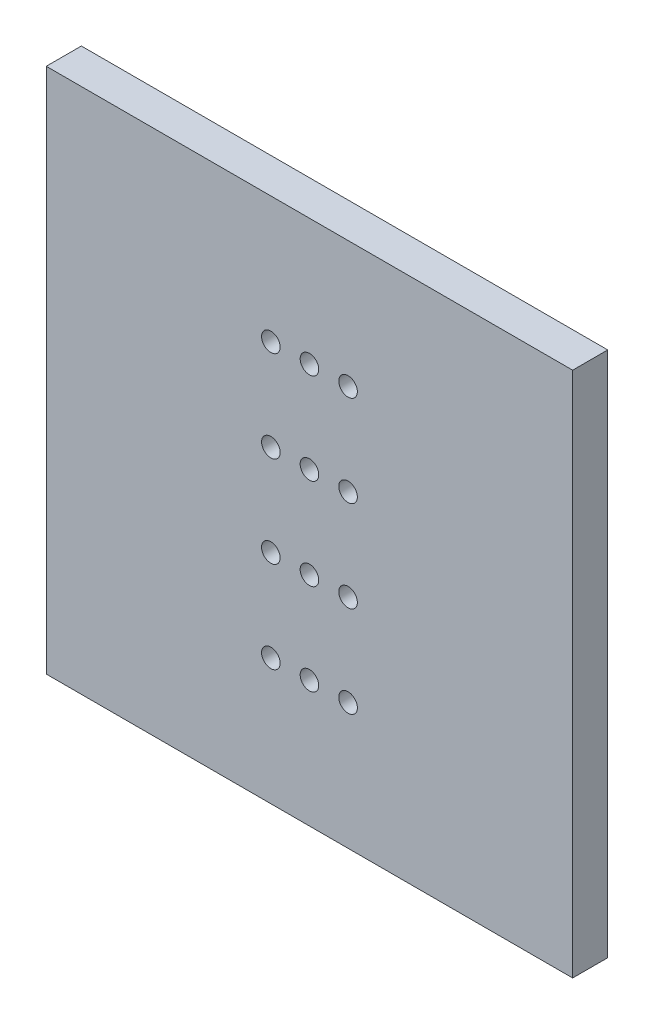
ISO-10303-21;
HEADER;
FILE_DESCRIPTION(('STEP AP214'),'2;1');
FILE_NAME('part.step','',(''),(''),'','','');
FILE_SCHEMA(('AUTOMOTIVE_DESIGN { 1 0 10303 214 1 1 1 1 }'));
ENDSEC;
DATA;
#1=APPLICATION_CONTEXT('core data for automotive mechanical design processes');
#2=APPLICATION_PROTOCOL_DEFINITION('international standard','automotive_design',2000,#1);
#3=PRODUCT_CONTEXT('',#1,'mechanical');
#4=PRODUCT('Part','Part','',(#3));
#5=PRODUCT_RELATED_PRODUCT_CATEGORY('part','',(#4));
#6=PRODUCT_DEFINITION_FORMATION('','',#4);
#7=PRODUCT_DEFINITION_CONTEXT('part definition',#1,'design');
#8=PRODUCT_DEFINITION('design','',#6,#7);
#9=PRODUCT_DEFINITION_SHAPE('','',#8);
#10=(LENGTH_UNIT() NAMED_UNIT(*) SI_UNIT(.MILLI.,.METRE.));
#11=(NAMED_UNIT(*) PLANE_ANGLE_UNIT() SI_UNIT($,.RADIAN.));
#12=(NAMED_UNIT(*) SI_UNIT($,.STERADIAN.) SOLID_ANGLE_UNIT());
#13=UNCERTAINTY_MEASURE_WITH_UNIT(LENGTH_MEASURE(1.E-05),#10,'distance_accuracy_value','');
#14=(GEOMETRIC_REPRESENTATION_CONTEXT(3) GLOBAL_UNCERTAINTY_ASSIGNED_CONTEXT((#13)) GLOBAL_UNIT_ASSIGNED_CONTEXT((#10,
#11,#12)) REPRESENTATION_CONTEXT('',''));
#15=CARTESIAN_POINT('',(0.,0.,0.));
#16=DIRECTION('',(0.,0.,1.));
#17=DIRECTION('',(1.,0.,0.));
#18=AXIS2_PLACEMENT_3D('',#15,#16,#17);
#19=CARTESIAN_POINT('',(15.,-15.,2.));
#20=DIRECTION('',(-1.,0.,0.));
#21=DIRECTION('',(0.,0.,1.));
#22=AXIS2_PLACEMENT_3D('',#19,#20,#21);
#23=PLANE('',#22);
#24=DIRECTION('',(0.,1.,0.));
#25=VECTOR('',#24,1.);
#26=CARTESIAN_POINT('',(15.,-15.,0.));
#27=LINE('',#26,#25);
#28=CARTESIAN_POINT('',(15.,-15.,0.));
#29=VERTEX_POINT('',#28);
#30=CARTESIAN_POINT('',(15.,15.,0.));
#31=VERTEX_POINT('',#30);
#32=EDGE_CURVE('E103',#29,#31,#27,.T.);
#33=ORIENTED_EDGE('',*,*,#32,.T.);
#34=DIRECTION('',(0.,0.,-1.));
#35=VECTOR('',#34,1.);
#36=CARTESIAN_POINT('',(15.,15.,2.));
#37=LINE('',#36,#35);
#38=CARTESIAN_POINT('',(15.,15.,2.));
#39=VERTEX_POINT('',#38);
#40=EDGE_CURVE('E11',#39,#31,#37,.T.);
#41=ORIENTED_EDGE('',*,*,#40,.F.);
#42=DIRECTION('',(0.,1.,0.));
#43=VECTOR('',#42,1.);
#44=CARTESIAN_POINT('',(15.,-15.,2.));
#45=LINE('',#44,#43);
#46=CARTESIAN_POINT('',(15.,-15.,2.));
#47=VERTEX_POINT('',#46);
#48=EDGE_CURVE('E90',#47,#39,#45,.T.);
#49=ORIENTED_EDGE('',*,*,#48,.F.);
#50=DIRECTION('',(0.,0.,-1.));
#51=VECTOR('',#50,1.);
#52=CARTESIAN_POINT('',(15.,-15.,2.));
#53=LINE('',#52,#51);
#54=EDGE_CURVE('E99',#47,#29,#53,.T.);
#55=ORIENTED_EDGE('',*,*,#54,.T.);
#56=EDGE_LOOP('',(#33,#41,#49,#55));
#57=FACE_BOUND('',#56,.T.);
#58=ADVANCED_FACE('F37',(#57),#23,.F.);
#59=CARTESIAN_POINT('',(-15.,15.,2.));
#60=DIRECTION('',(0.,-1.,0.));
#61=DIRECTION('',(0.,0.,-1.));
#62=AXIS2_PLACEMENT_3D('',#59,#60,#61);
#63=PLANE('',#62);
#64=DIRECTION('',(-1.,0.,0.));
#65=VECTOR('',#64,1.);
#66=CARTESIAN_POINT('',(-15.,15.,0.));
#67=LINE('',#66,#65);
#68=CARTESIAN_POINT('',(-15.,15.,0.));
#69=VERTEX_POINT('',#68);
#70=EDGE_CURVE('E94',#31,#69,#67,.T.);
#71=ORIENTED_EDGE('',*,*,#70,.T.);
#72=DIRECTION('',(0.,0.,-1.));
#73=VECTOR('',#72,1.);
#74=CARTESIAN_POINT('',(-15.,15.,2.));
#75=LINE('',#74,#73);
#76=CARTESIAN_POINT('',(-15.,15.,2.));
#77=VERTEX_POINT('',#76);
#78=EDGE_CURVE('E46',#77,#69,#75,.T.);
#79=ORIENTED_EDGE('',*,*,#78,.F.);
#80=DIRECTION('',(-1.,0.,0.));
#81=VECTOR('',#80,1.);
#82=CARTESIAN_POINT('',(-15.,15.,2.));
#83=LINE('',#82,#81);
#84=EDGE_CURVE('E85',#39,#77,#83,.T.);
#85=ORIENTED_EDGE('',*,*,#84,.F.);
#86=ORIENTED_EDGE('',*,*,#40,.T.);
#87=EDGE_LOOP('',(#71,#79,#85,#86));
#88=FACE_BOUND('',#87,.T.);
#89=ADVANCED_FACE('F93',(#88),#63,.F.);
#90=CARTESIAN_POINT('',(-15.,-15.,2.));
#91=DIRECTION('',(1.,0.,0.));
#92=DIRECTION('',(0.,0.,-1.));
#93=AXIS2_PLACEMENT_3D('',#90,#91,#92);
#94=PLANE('',#93);
#95=DIRECTION('',(0.,-1.,0.));
#96=VECTOR('',#95,1.);
#97=CARTESIAN_POINT('',(-15.,-15.,0.));
#98=LINE('',#97,#96);
#99=CARTESIAN_POINT('',(-15.,-15.,0.));
#100=VERTEX_POINT('',#99);
#101=EDGE_CURVE('E72',#69,#100,#98,.T.);
#102=ORIENTED_EDGE('',*,*,#101,.T.);
#103=DIRECTION('',(0.,0.,-1.));
#104=VECTOR('',#103,1.);
#105=CARTESIAN_POINT('',(-15.,-15.,2.));
#106=LINE('',#105,#104);
#107=CARTESIAN_POINT('',(-15.,-15.,2.));
#108=VERTEX_POINT('',#107);
#109=EDGE_CURVE('E95',#108,#100,#106,.T.);
#110=ORIENTED_EDGE('',*,*,#109,.F.);
#111=DIRECTION('',(0.,-1.,0.));
#112=VECTOR('',#111,1.);
#113=CARTESIAN_POINT('',(-15.,-15.,2.));
#114=LINE('',#113,#112);
#115=EDGE_CURVE('E88',#77,#108,#114,.T.);
#116=ORIENTED_EDGE('',*,*,#115,.F.);
#117=ORIENTED_EDGE('',*,*,#78,.T.);
#118=EDGE_LOOP('',(#102,#110,#116,#117));
#119=FACE_BOUND('',#118,.T.);
#120=ADVANCED_FACE('F97',(#119),#94,.F.);
#121=CARTESIAN_POINT('',(-15.,-15.,2.));
#122=DIRECTION('',(0.,1.,0.));
#123=DIRECTION('',(0.,0.,1.));
#124=AXIS2_PLACEMENT_3D('',#121,#122,#123);
#125=PLANE('',#124);
#126=DIRECTION('',(1.,0.,0.));
#127=VECTOR('',#126,1.);
#128=CARTESIAN_POINT('',(-15.,-15.,0.));
#129=LINE('',#128,#127);
#130=EDGE_CURVE('E78',#100,#29,#129,.T.);
#131=ORIENTED_EDGE('',*,*,#130,.T.);
#132=ORIENTED_EDGE('',*,*,#54,.F.);
#133=DIRECTION('',(1.,0.,0.));
#134=VECTOR('',#133,1.);
#135=CARTESIAN_POINT('',(-15.,-15.,2.));
#136=LINE('',#135,#134);
#137=EDGE_CURVE('E55',#108,#47,#136,.T.);
#138=ORIENTED_EDGE('',*,*,#137,.F.);
#139=ORIENTED_EDGE('',*,*,#109,.T.);
#140=EDGE_LOOP('',(#131,#132,#138,#139));
#141=FACE_BOUND('',#140,.T.);
#142=ADVANCED_FACE('F179',(#141),#125,.F.);
#143=CARTESIAN_POINT('',(0.,0.,2.));
#144=DIRECTION('',(0.,0.,-1.));
#145=DIRECTION('',(-1.,0.,0.));
#146=AXIS2_PLACEMENT_3D('',#143,#144,#145);
#147=PLANE('',#146);
#148=CARTESIAN_POINT('',(0.,-2.6,2.));
#149=DIRECTION('',(0.,0.,1.));
#150=DIRECTION('',(1.,0.,0.));
#151=AXIS2_PLACEMENT_3D('',#148,#149,#150);
#152=CIRCLE('',#151,0.53);
#153=CARTESIAN_POINT('',(0.53,-2.6,2.));
#154=VERTEX_POINT('',#153);
#155=EDGE_CURVE('E382',#154,#154,#152,.T.);
#156=ORIENTED_EDGE('',*,*,#155,.F.);
#157=EDGE_LOOP('',(#156));
#158=FACE_BOUND('',#157,.T.);
#159=CARTESIAN_POINT('',(0.,2.6,2.));
#160=DIRECTION('',(0.,0.,1.));
#161=DIRECTION('',(1.,0.,0.));
#162=AXIS2_PLACEMENT_3D('',#159,#160,#161);
#163=CIRCLE('',#162,0.53);
#164=CARTESIAN_POINT('',(0.53,2.6,2.));
#165=VERTEX_POINT('',#164);
#166=EDGE_CURVE('E380',#165,#165,#163,.T.);
#167=ORIENTED_EDGE('',*,*,#166,.F.);
#168=EDGE_LOOP('',(#167));
#169=FACE_BOUND('',#168,.T.);
#170=CARTESIAN_POINT('',(0.,7.8,2.));
#171=DIRECTION('',(0.,0.,1.));
#172=DIRECTION('',(1.,0.,0.));
#173=AXIS2_PLACEMENT_3D('',#170,#171,#172);
#174=CIRCLE('',#173,0.53);
#175=CARTESIAN_POINT('',(0.53,7.8,2.));
#176=VERTEX_POINT('',#175);
#177=EDGE_CURVE('E383',#176,#176,#174,.T.);
#178=ORIENTED_EDGE('',*,*,#177,.F.);
#179=EDGE_LOOP('',(#178));
#180=FACE_BOUND('',#179,.T.);
#181=CARTESIAN_POINT('',(2.2,-7.8,2.));
#182=DIRECTION('',(0.,0.,1.));
#183=DIRECTION('',(1.,0.,0.));
#184=AXIS2_PLACEMENT_3D('',#181,#182,#183);
#185=CIRCLE('',#184,0.53);
#186=CARTESIAN_POINT('',(2.73,-7.8,2.));
#187=VERTEX_POINT('',#186);
#188=EDGE_CURVE('E389',#187,#187,#185,.T.);
#189=ORIENTED_EDGE('',*,*,#188,.F.);
#190=EDGE_LOOP('',(#189));
#191=FACE_BOUND('',#190,.T.);
#192=CARTESIAN_POINT('',(-2.2,-2.6,2.));
#193=DIRECTION('',(0.,0.,1.));
#194=DIRECTION('',(1.,0.,0.));
#195=AXIS2_PLACEMENT_3D('',#192,#193,#194);
#196=CIRCLE('',#195,0.53);
#197=CARTESIAN_POINT('',(-1.67,-2.6,2.));
#198=VERTEX_POINT('',#197);
#199=EDGE_CURVE('E399',#198,#198,#196,.T.);
#200=ORIENTED_EDGE('',*,*,#199,.F.);
#201=EDGE_LOOP('',(#200));
#202=FACE_BOUND('',#201,.T.);
#203=CARTESIAN_POINT('',(-2.2,2.6,2.));
#204=DIRECTION('',(0.,0.,1.));
#205=DIRECTION('',(1.,0.,0.));
#206=AXIS2_PLACEMENT_3D('',#203,#204,#205);
#207=CIRCLE('',#206,0.53);
#208=CARTESIAN_POINT('',(-1.67,2.6,2.));
#209=VERTEX_POINT('',#208);
#210=EDGE_CURVE('E396',#209,#209,#207,.T.);
#211=ORIENTED_EDGE('',*,*,#210,.F.);
#212=EDGE_LOOP('',(#211));
#213=FACE_BOUND('',#212,.T.);
#214=CARTESIAN_POINT('',(-2.2,7.8,2.));
#215=DIRECTION('',(0.,0.,1.));
#216=DIRECTION('',(1.,0.,0.));
#217=AXIS2_PLACEMENT_3D('',#214,#215,#216);
#218=CIRCLE('',#217,0.53);
#219=CARTESIAN_POINT('',(-1.67,7.8,2.));
#220=VERTEX_POINT('',#219);
#221=EDGE_CURVE('E393',#220,#220,#218,.T.);
#222=ORIENTED_EDGE('',*,*,#221,.F.);
#223=EDGE_LOOP('',(#222));
#224=FACE_BOUND('',#223,.T.);
#225=CARTESIAN_POINT('',(0.,-7.8,2.));
#226=DIRECTION('',(0.,0.,1.));
#227=DIRECTION('',(1.,0.,0.));
#228=AXIS2_PLACEMENT_3D('',#225,#226,#227);
#229=CIRCLE('',#228,0.53);
#230=CARTESIAN_POINT('',(0.53,-7.8,2.));
#231=VERTEX_POINT('',#230);
#232=EDGE_CURVE('E386',#231,#231,#229,.T.);
#233=ORIENTED_EDGE('',*,*,#232,.F.);
#234=EDGE_LOOP('',(#233));
#235=FACE_BOUND('',#234,.T.);
#236=CARTESIAN_POINT('',(2.2,-2.6,2.));
#237=DIRECTION('',(0.,0.,1.));
#238=DIRECTION('',(1.,0.,0.));
#239=AXIS2_PLACEMENT_3D('',#236,#237,#238);
#240=CIRCLE('',#239,0.53);
#241=CARTESIAN_POINT('',(2.73,-2.6,2.));
#242=VERTEX_POINT('',#241);
#243=EDGE_CURVE('E419',#242,#242,#240,.T.);
#244=ORIENTED_EDGE('',*,*,#243,.F.);
#245=EDGE_LOOP('',(#244));
#246=FACE_BOUND('',#245,.T.);
#247=CARTESIAN_POINT('',(2.2,2.6,2.));
#248=DIRECTION('',(0.,0.,1.));
#249=DIRECTION('',(1.,0.,0.));
#250=AXIS2_PLACEMENT_3D('',#247,#248,#249);
#251=CIRCLE('',#250,0.53);
#252=CARTESIAN_POINT('',(2.73,2.6,2.));
#253=VERTEX_POINT('',#252);
#254=EDGE_CURVE('E423',#253,#253,#251,.T.);
#255=ORIENTED_EDGE('',*,*,#254,.F.);
#256=EDGE_LOOP('',(#255));
#257=FACE_BOUND('',#256,.T.);
#258=CARTESIAN_POINT('',(2.2,7.8,2.));
#259=DIRECTION('',(0.,0.,1.));
#260=DIRECTION('',(1.,0.,0.));
#261=AXIS2_PLACEMENT_3D('',#258,#259,#260);
#262=CIRCLE('',#261,0.53);
#263=CARTESIAN_POINT('',(2.73,7.8,2.));
#264=VERTEX_POINT('',#263);
#265=EDGE_CURVE('E426',#264,#264,#262,.T.);
#266=ORIENTED_EDGE('',*,*,#265,.F.);
#267=EDGE_LOOP('',(#266));
#268=FACE_BOUND('',#267,.T.);
#269=CARTESIAN_POINT('',(-2.2,-7.8,2.));
#270=DIRECTION('',(0.,0.,1.));
#271=DIRECTION('',(1.,0.,0.));
#272=AXIS2_PLACEMENT_3D('',#269,#270,#271);
#273=CIRCLE('',#272,0.53);
#274=CARTESIAN_POINT('',(-1.67,-7.8,2.));
#275=VERTEX_POINT('',#274);
#276=EDGE_CURVE('E115',#275,#275,#273,.T.);
#277=ORIENTED_EDGE('',*,*,#276,.F.);
#278=EDGE_LOOP('',(#277));
#279=FACE_BOUND('',#278,.T.);
#280=ORIENTED_EDGE('',*,*,#48,.T.);
#281=ORIENTED_EDGE('',*,*,#84,.T.);
#282=ORIENTED_EDGE('',*,*,#115,.T.);
#283=ORIENTED_EDGE('',*,*,#137,.T.);
#284=EDGE_LOOP('',(#280,#281,#282,#283));
#285=FACE_BOUND('',#284,.T.);
#286=ADVANCED_FACE('F86',(#158,#169,#180,#191,#202,#213,#224,#235,#246,#257,#268,#279,#285),
#147,.F.);
#287=CARTESIAN_POINT('',(0.,0.,0.));
#288=DIRECTION('',(0.,0.,-1.));
#289=DIRECTION('',(-1.,0.,0.));
#290=AXIS2_PLACEMENT_3D('',#287,#288,#289);
#291=PLANE('',#290);
#292=CARTESIAN_POINT('',(0.,-2.6,0.));
#293=DIRECTION('',(0.,0.,-1.));
#294=DIRECTION('',(-1.,0.,0.));
#295=AXIS2_PLACEMENT_3D('',#292,#293,#294);
#296=CIRCLE('',#295,0.53);
#297=CARTESIAN_POINT('',(-0.53,-2.6,0.));
#298=VERTEX_POINT('',#297);
#299=EDGE_CURVE('E40',#298,#298,#296,.T.);
#300=ORIENTED_EDGE('',*,*,#299,.F.);
#301=EDGE_LOOP('',(#300));
#302=FACE_BOUND('',#301,.T.);
#303=CARTESIAN_POINT('',(0.,2.6,0.));
#304=DIRECTION('',(0.,0.,-1.));
#305=DIRECTION('',(-1.,0.,0.));
#306=AXIS2_PLACEMENT_3D('',#303,#304,#305);
#307=CIRCLE('',#306,0.53);
#308=CARTESIAN_POINT('',(-0.53,2.6,0.));
#309=VERTEX_POINT('',#308);
#310=EDGE_CURVE('E141',#309,#309,#307,.T.);
#311=ORIENTED_EDGE('',*,*,#310,.F.);
#312=EDGE_LOOP('',(#311));
#313=FACE_BOUND('',#312,.T.);
#314=CARTESIAN_POINT('',(0.,7.8,0.));
#315=DIRECTION('',(0.,0.,-1.));
#316=DIRECTION('',(-1.,0.,0.));
#317=AXIS2_PLACEMENT_3D('',#314,#315,#316);
#318=CIRCLE('',#317,0.53);
#319=CARTESIAN_POINT('',(-0.53,7.8,0.));
#320=VERTEX_POINT('',#319);
#321=EDGE_CURVE('E139',#320,#320,#318,.T.);
#322=ORIENTED_EDGE('',*,*,#321,.F.);
#323=EDGE_LOOP('',(#322));
#324=FACE_BOUND('',#323,.T.);
#325=CARTESIAN_POINT('',(2.2,-7.8,0.));
#326=DIRECTION('',(0.,0.,-1.));
#327=DIRECTION('',(-1.,0.,0.));
#328=AXIS2_PLACEMENT_3D('',#325,#326,#327);
#329=CIRCLE('',#328,0.53);
#330=CARTESIAN_POINT('',(1.67,-7.8,0.));
#331=VERTEX_POINT('',#330);
#332=EDGE_CURVE('E136',#331,#331,#329,.T.);
#333=ORIENTED_EDGE('',*,*,#332,.F.);
#334=EDGE_LOOP('',(#333));
#335=FACE_BOUND('',#334,.T.);
#336=CARTESIAN_POINT('',(-2.2,-2.6,0.));
#337=DIRECTION('',(0.,0.,-1.));
#338=DIRECTION('',(-1.,0.,0.));
#339=AXIS2_PLACEMENT_3D('',#336,#337,#338);
#340=CIRCLE('',#339,0.53);
#341=CARTESIAN_POINT('',(-2.73,-2.6,0.));
#342=VERTEX_POINT('',#341);
#343=EDGE_CURVE('E133',#342,#342,#340,.T.);
#344=ORIENTED_EDGE('',*,*,#343,.F.);
#345=EDGE_LOOP('',(#344));
#346=FACE_BOUND('',#345,.T.);
#347=CARTESIAN_POINT('',(-2.2,2.6,0.));
#348=DIRECTION('',(0.,0.,-1.));
#349=DIRECTION('',(-1.,0.,0.));
#350=AXIS2_PLACEMENT_3D('',#347,#348,#349);
#351=CIRCLE('',#350,0.53);
#352=CARTESIAN_POINT('',(-2.73,2.6,0.));
#353=VERTEX_POINT('',#352);
#354=EDGE_CURVE('E130',#353,#353,#351,.T.);
#355=ORIENTED_EDGE('',*,*,#354,.F.);
#356=EDGE_LOOP('',(#355));
#357=FACE_BOUND('',#356,.T.);
#358=CARTESIAN_POINT('',(-2.2,7.8,0.));
#359=DIRECTION('',(0.,0.,-1.));
#360=DIRECTION('',(-1.,0.,0.));
#361=AXIS2_PLACEMENT_3D('',#358,#359,#360);
#362=CIRCLE('',#361,0.53);
#363=CARTESIAN_POINT('',(-2.73,7.8,0.));
#364=VERTEX_POINT('',#363);
#365=EDGE_CURVE('E127',#364,#364,#362,.T.);
#366=ORIENTED_EDGE('',*,*,#365,.F.);
#367=EDGE_LOOP('',(#366));
#368=FACE_BOUND('',#367,.T.);
#369=CARTESIAN_POINT('',(0.,-7.8,0.));
#370=DIRECTION('',(0.,0.,-1.));
#371=DIRECTION('',(-1.,0.,0.));
#372=AXIS2_PLACEMENT_3D('',#369,#370,#371);
#373=CIRCLE('',#372,0.53);
#374=CARTESIAN_POINT('',(-0.53,-7.8,0.));
#375=VERTEX_POINT('',#374);
#376=EDGE_CURVE('E124',#375,#375,#373,.T.);
#377=ORIENTED_EDGE('',*,*,#376,.F.);
#378=EDGE_LOOP('',(#377));
#379=FACE_BOUND('',#378,.T.);
#380=CARTESIAN_POINT('',(2.2,-2.6,0.));
#381=DIRECTION('',(0.,0.,-1.));
#382=DIRECTION('',(-1.,0.,0.));
#383=AXIS2_PLACEMENT_3D('',#380,#381,#382);
#384=CIRCLE('',#383,0.53);
#385=CARTESIAN_POINT('',(1.67,-2.6,0.));
#386=VERTEX_POINT('',#385);
#387=EDGE_CURVE('E121',#386,#386,#384,.T.);
#388=ORIENTED_EDGE('',*,*,#387,.F.);
#389=EDGE_LOOP('',(#388));
#390=FACE_BOUND('',#389,.T.);
#391=CARTESIAN_POINT('',(2.2,2.6,0.));
#392=DIRECTION('',(0.,0.,-1.));
#393=DIRECTION('',(-1.,0.,0.));
#394=AXIS2_PLACEMENT_3D('',#391,#392,#393);
#395=CIRCLE('',#394,0.53);
#396=CARTESIAN_POINT('',(1.67,2.6,0.));
#397=VERTEX_POINT('',#396);
#398=EDGE_CURVE('E118',#397,#397,#395,.T.);
#399=ORIENTED_EDGE('',*,*,#398,.F.);
#400=EDGE_LOOP('',(#399));
#401=FACE_BOUND('',#400,.T.);
#402=CARTESIAN_POINT('',(2.2,7.8,0.));
#403=DIRECTION('',(0.,0.,-1.));
#404=DIRECTION('',(-1.,0.,0.));
#405=AXIS2_PLACEMENT_3D('',#402,#403,#404);
#406=CIRCLE('',#405,0.53);
#407=CARTESIAN_POINT('',(1.67,7.8,0.));
#408=VERTEX_POINT('',#407);
#409=EDGE_CURVE('E114',#408,#408,#406,.T.);
#410=ORIENTED_EDGE('',*,*,#409,.F.);
#411=EDGE_LOOP('',(#410));
#412=FACE_BOUND('',#411,.T.);
#413=CARTESIAN_POINT('',(-2.2,-7.8,0.));
#414=DIRECTION('',(0.,0.,-1.));
#415=DIRECTION('',(-1.,0.,0.));
#416=AXIS2_PLACEMENT_3D('',#413,#414,#415);
#417=CIRCLE('',#416,0.53);
#418=CARTESIAN_POINT('',(-2.73,-7.8,0.));
#419=VERTEX_POINT('',#418);
#420=EDGE_CURVE('E111',#419,#419,#417,.T.);
#421=ORIENTED_EDGE('',*,*,#420,.F.);
#422=EDGE_LOOP('',(#421));
#423=FACE_BOUND('',#422,.T.);
#424=ORIENTED_EDGE('',*,*,#32,.F.);
#425=ORIENTED_EDGE('',*,*,#130,.F.);
#426=ORIENTED_EDGE('',*,*,#101,.F.);
#427=ORIENTED_EDGE('',*,*,#70,.F.);
#428=EDGE_LOOP('',(#424,#425,#426,#427));
#429=FACE_BOUND('',#428,.T.);
#430=ADVANCED_FACE('F151',(#302,#313,#324,#335,#346,#357,#368,#379,#390,#401,#412,#423,#429),
#291,.T.);
#431=CARTESIAN_POINT('',(-2.2,-7.8,-8.));
#432=DIRECTION('',(0.,0.,1.));
#433=DIRECTION('',(1.,0.,0.));
#434=AXIS2_PLACEMENT_3D('',#431,#432,#433);
#435=CYLINDRICAL_SURFACE('',#434,0.53);
#436=ORIENTED_EDGE('',*,*,#420,.T.);
#437=EDGE_LOOP('',(#436));
#438=FACE_BOUND('',#437,.T.);
#439=ORIENTED_EDGE('',*,*,#276,.T.);
#440=EDGE_LOOP('',(#439));
#441=FACE_BOUND('',#440,.T.);
#442=ADVANCED_FACE('F154',(#438,#441),#435,.F.);
#443=CARTESIAN_POINT('',(2.2,7.8,-8.));
#444=DIRECTION('',(0.,0.,1.));
#445=DIRECTION('',(1.,0.,0.));
#446=AXIS2_PLACEMENT_3D('',#443,#444,#445);
#447=CYLINDRICAL_SURFACE('',#446,0.53);
#448=ORIENTED_EDGE('',*,*,#409,.T.);
#449=EDGE_LOOP('',(#448));
#450=FACE_BOUND('',#449,.T.);
#451=ORIENTED_EDGE('',*,*,#265,.T.);
#452=EDGE_LOOP('',(#451));
#453=FACE_BOUND('',#452,.T.);
#454=ADVANCED_FACE('F228',(#450,#453),#447,.F.);
#455=CARTESIAN_POINT('',(2.2,2.6,-8.));
#456=DIRECTION('',(0.,0.,1.));
#457=DIRECTION('',(1.,0.,0.));
#458=AXIS2_PLACEMENT_3D('',#455,#456,#457);
#459=CYLINDRICAL_SURFACE('',#458,0.53);
#460=ORIENTED_EDGE('',*,*,#398,.T.);
#461=EDGE_LOOP('',(#460));
#462=FACE_BOUND('',#461,.T.);
#463=ORIENTED_EDGE('',*,*,#254,.T.);
#464=EDGE_LOOP('',(#463));
#465=FACE_BOUND('',#464,.T.);
#466=ADVANCED_FACE('F239',(#462,#465),#459,.F.);
#467=CARTESIAN_POINT('',(2.2,-2.6,-8.));
#468=DIRECTION('',(0.,0.,1.));
#469=DIRECTION('',(1.,0.,0.));
#470=AXIS2_PLACEMENT_3D('',#467,#468,#469);
#471=CYLINDRICAL_SURFACE('',#470,0.53);
#472=ORIENTED_EDGE('',*,*,#387,.T.);
#473=EDGE_LOOP('',(#472));
#474=FACE_BOUND('',#473,.T.);
#475=ORIENTED_EDGE('',*,*,#243,.T.);
#476=EDGE_LOOP('',(#475));
#477=FACE_BOUND('',#476,.T.);
#478=ADVANCED_FACE('F250',(#474,#477),#471,.F.);
#479=CARTESIAN_POINT('',(0.,-7.8,-8.));
#480=DIRECTION('',(0.,0.,1.));
#481=DIRECTION('',(1.,0.,0.));
#482=AXIS2_PLACEMENT_3D('',#479,#480,#481);
#483=CYLINDRICAL_SURFACE('',#482,0.53);
#484=ORIENTED_EDGE('',*,*,#376,.T.);
#485=EDGE_LOOP('',(#484));
#486=FACE_BOUND('',#485,.T.);
#487=ORIENTED_EDGE('',*,*,#232,.T.);
#488=EDGE_LOOP('',(#487));
#489=FACE_BOUND('',#488,.T.);
#490=ADVANCED_FACE('F261',(#486,#489),#483,.F.);
#491=CARTESIAN_POINT('',(-2.2,7.8,-8.));
#492=DIRECTION('',(0.,0.,1.));
#493=DIRECTION('',(1.,0.,0.));
#494=AXIS2_PLACEMENT_3D('',#491,#492,#493);
#495=CYLINDRICAL_SURFACE('',#494,0.53);
#496=ORIENTED_EDGE('',*,*,#365,.T.);
#497=EDGE_LOOP('',(#496));
#498=FACE_BOUND('',#497,.T.);
#499=ORIENTED_EDGE('',*,*,#221,.T.);
#500=EDGE_LOOP('',(#499));
#501=FACE_BOUND('',#500,.T.);
#502=ADVANCED_FACE('F272',(#498,#501),#495,.F.);
#503=CARTESIAN_POINT('',(-2.2,2.6,-8.));
#504=DIRECTION('',(0.,0.,1.));
#505=DIRECTION('',(1.,0.,0.));
#506=AXIS2_PLACEMENT_3D('',#503,#504,#505);
#507=CYLINDRICAL_SURFACE('',#506,0.53);
#508=ORIENTED_EDGE('',*,*,#354,.T.);
#509=EDGE_LOOP('',(#508));
#510=FACE_BOUND('',#509,.T.);
#511=ORIENTED_EDGE('',*,*,#210,.T.);
#512=EDGE_LOOP('',(#511));
#513=FACE_BOUND('',#512,.T.);
#514=ADVANCED_FACE('F283',(#510,#513),#507,.F.);
#515=CARTESIAN_POINT('',(-2.2,-2.6,-8.));
#516=DIRECTION('',(0.,0.,1.));
#517=DIRECTION('',(1.,0.,0.));
#518=AXIS2_PLACEMENT_3D('',#515,#516,#517);
#519=CYLINDRICAL_SURFACE('',#518,0.53);
#520=ORIENTED_EDGE('',*,*,#343,.T.);
#521=EDGE_LOOP('',(#520));
#522=FACE_BOUND('',#521,.T.);
#523=ORIENTED_EDGE('',*,*,#199,.T.);
#524=EDGE_LOOP('',(#523));
#525=FACE_BOUND('',#524,.T.);
#526=ADVANCED_FACE('F294',(#522,#525),#519,.F.);
#527=CARTESIAN_POINT('',(2.2,-7.8,-8.));
#528=DIRECTION('',(0.,0.,1.));
#529=DIRECTION('',(1.,0.,0.));
#530=AXIS2_PLACEMENT_3D('',#527,#528,#529);
#531=CYLINDRICAL_SURFACE('',#530,0.53);
#532=ORIENTED_EDGE('',*,*,#332,.T.);
#533=EDGE_LOOP('',(#532));
#534=FACE_BOUND('',#533,.T.);
#535=ORIENTED_EDGE('',*,*,#188,.T.);
#536=EDGE_LOOP('',(#535));
#537=FACE_BOUND('',#536,.T.);
#538=ADVANCED_FACE('F305',(#534,#537),#531,.F.);
#539=CARTESIAN_POINT('',(0.,7.8,-8.));
#540=DIRECTION('',(0.,0.,1.));
#541=DIRECTION('',(1.,0.,0.));
#542=AXIS2_PLACEMENT_3D('',#539,#540,#541);
#543=CYLINDRICAL_SURFACE('',#542,0.53);
#544=ORIENTED_EDGE('',*,*,#321,.T.);
#545=EDGE_LOOP('',(#544));
#546=FACE_BOUND('',#545,.T.);
#547=ORIENTED_EDGE('',*,*,#177,.T.);
#548=EDGE_LOOP('',(#547));
#549=FACE_BOUND('',#548,.T.);
#550=ADVANCED_FACE('F316',(#546,#549),#543,.F.);
#551=CARTESIAN_POINT('',(0.,2.6,-8.));
#552=DIRECTION('',(0.,0.,1.));
#553=DIRECTION('',(1.,0.,0.));
#554=AXIS2_PLACEMENT_3D('',#551,#552,#553);
#555=CYLINDRICAL_SURFACE('',#554,0.53);
#556=ORIENTED_EDGE('',*,*,#310,.T.);
#557=EDGE_LOOP('',(#556));
#558=FACE_BOUND('',#557,.T.);
#559=ORIENTED_EDGE('',*,*,#166,.T.);
#560=EDGE_LOOP('',(#559));
#561=FACE_BOUND('',#560,.T.);
#562=ADVANCED_FACE('F327',(#558,#561),#555,.F.);
#563=CARTESIAN_POINT('',(0.,-2.6,-8.));
#564=DIRECTION('',(0.,0.,1.));
#565=DIRECTION('',(1.,0.,0.));
#566=AXIS2_PLACEMENT_3D('',#563,#564,#565);
#567=CYLINDRICAL_SURFACE('',#566,0.53);
#568=ORIENTED_EDGE('',*,*,#299,.T.);
#569=EDGE_LOOP('',(#568));
#570=FACE_BOUND('',#569,.T.);
#571=ORIENTED_EDGE('',*,*,#155,.T.);
#572=EDGE_LOOP('',(#571));
#573=FACE_BOUND('',#572,.T.);
#574=ADVANCED_FACE('F148',(#570,#573),#567,.F.);
#575=CLOSED_SHELL('',(#58,#89,#120,#142,#286,#430,#442,#454,#466,#478,#490,#502,#514,#526,#538,
#550,#562,#574));
#576=MANIFOLD_SOLID_BREP('B2',#575);
#577=ADVANCED_BREP_SHAPE_REPRESENTATION('',(#18,#576),#14);
#578=SHAPE_DEFINITION_REPRESENTATION(#9,#577);
ENDSEC;
END-ISO-10303-21;
